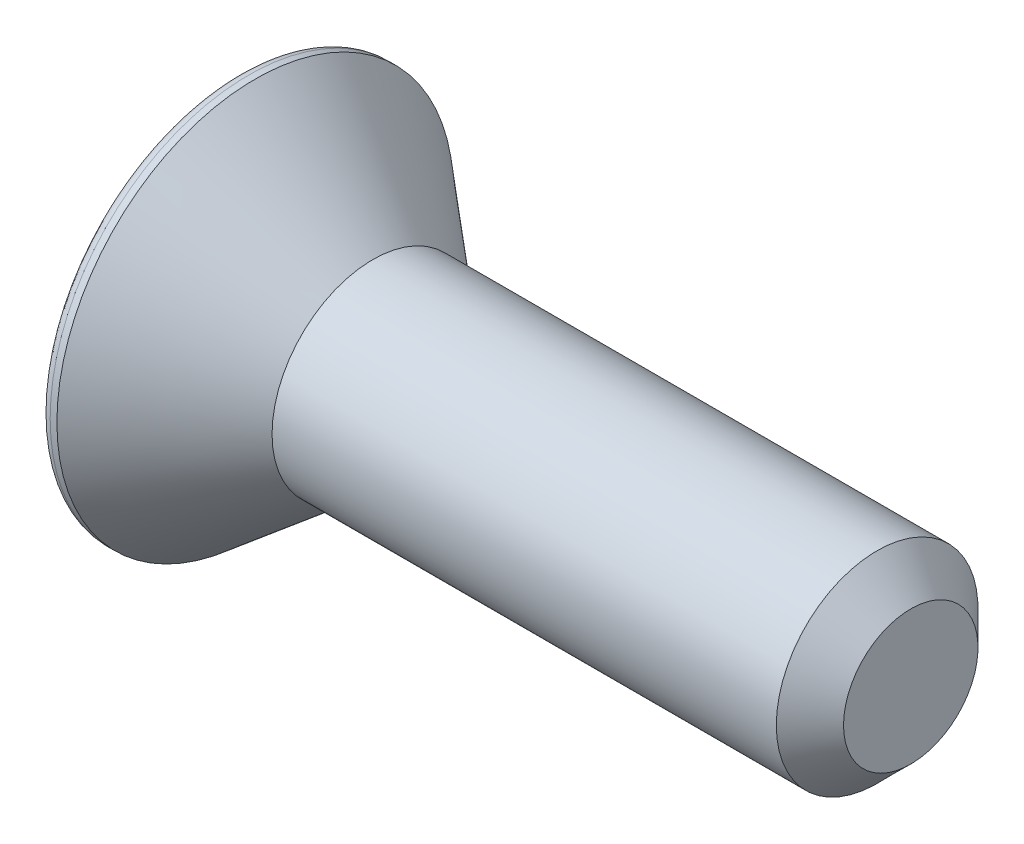
ISO-10303-21;
HEADER;
FILE_DESCRIPTION(('STEP AP214'),'2;1');
FILE_NAME('part.step','',(''),(''),'','','');
FILE_SCHEMA(('AUTOMOTIVE_DESIGN { 1 0 10303 214 1 1 1 1 }'));
ENDSEC;
DATA;
#1=APPLICATION_CONTEXT('core data for automotive mechanical design processes');
#2=APPLICATION_PROTOCOL_DEFINITION('international standard','automotive_design',2000,#1);
#3=PRODUCT_CONTEXT('',#1,'mechanical');
#4=PRODUCT('Part','Part','',(#3));
#5=PRODUCT_RELATED_PRODUCT_CATEGORY('part','',(#4));
#6=PRODUCT_DEFINITION_FORMATION('','',#4);
#7=PRODUCT_DEFINITION_CONTEXT('part definition',#1,'design');
#8=PRODUCT_DEFINITION('design','',#6,#7);
#9=PRODUCT_DEFINITION_SHAPE('','',#8);
#10=(LENGTH_UNIT() NAMED_UNIT(*) SI_UNIT(.MILLI.,.METRE.));
#11=(NAMED_UNIT(*) PLANE_ANGLE_UNIT() SI_UNIT($,.RADIAN.));
#12=(NAMED_UNIT(*) SI_UNIT($,.STERADIAN.) SOLID_ANGLE_UNIT());
#13=UNCERTAINTY_MEASURE_WITH_UNIT(LENGTH_MEASURE(1.E-05),#10,'distance_accuracy_value','');
#14=(GEOMETRIC_REPRESENTATION_CONTEXT(3) GLOBAL_UNCERTAINTY_ASSIGNED_CONTEXT((#13)) GLOBAL_UNIT_ASSIGNED_CONTEXT((#10,
#11,#12)) REPRESENTATION_CONTEXT('',''));
#15=CARTESIAN_POINT('',(0.,0.,0.));
#16=DIRECTION('',(0.,0.,1.));
#17=DIRECTION('',(1.,0.,0.));
#18=AXIS2_PLACEMENT_3D('',#15,#16,#17);
#19=CARTESIAN_POINT('',(0.,0.,0.));
#20=DIRECTION('',(1.,0.,0.));
#21=DIRECTION('',(0.,0.,-1.));
#22=AXIS2_PLACEMENT_3D('',#19,#20,#21);
#23=PLANE('',#22);
#24=CARTESIAN_POINT('',(0.,0.,0.));
#25=DIRECTION('',(1.,0.,0.));
#26=DIRECTION('',(0.,0.,-1.));
#27=AXIS2_PLACEMENT_3D('',#24,#25,#26);
#28=CIRCLE('',#27,5.6);
#29=CARTESIAN_POINT('',(0.,0.,-5.6));
#30=VERTEX_POINT('',#29);
#31=EDGE_CURVE('E153',#30,#30,#28,.F.);
#32=ORIENTED_EDGE('',*,*,#31,.T.);
#33=EDGE_LOOP('',(#32));
#34=FACE_BOUND('',#33,.T.);
#35=DIRECTION('',(0.,0.,-1.));
#36=VECTOR('',#35,1.);
#37=CARTESIAN_POINT('',(0.,2.,1.15470053837925));
#38=LINE('',#37,#36);
#39=CARTESIAN_POINT('',(0.,2.,1.15470053837925));
#40=VERTEX_POINT('',#39);
#41=CARTESIAN_POINT('',(0.,2.,-1.15470053837925));
#42=VERTEX_POINT('',#41);
#43=EDGE_CURVE('E129',#40,#42,#38,.T.);
#44=ORIENTED_EDGE('',*,*,#43,.F.);
#45=DIRECTION('',(0.,0.866025403784438,-0.5));
#46=VECTOR('',#45,1.);
#47=CARTESIAN_POINT('',(0.,0.,2.3094010767585));
#48=LINE('',#47,#46);
#49=CARTESIAN_POINT('',(0.,0.,2.3094010767585));
#50=VERTEX_POINT('',#49);
#51=EDGE_CURVE('E55',#50,#40,#48,.T.);
#52=ORIENTED_EDGE('',*,*,#51,.F.);
#53=DIRECTION('',(0.,0.866025403784438,0.5));
#54=VECTOR('',#53,1.);
#55=CARTESIAN_POINT('',(0.,-2.,1.15470053837925));
#56=LINE('',#55,#54);
#57=CARTESIAN_POINT('',(0.,-2.,1.15470053837925));
#58=VERTEX_POINT('',#57);
#59=EDGE_CURVE('E138',#58,#50,#56,.T.);
#60=ORIENTED_EDGE('',*,*,#59,.F.);
#61=DIRECTION('',(0.,0.,1.));
#62=VECTOR('',#61,1.);
#63=CARTESIAN_POINT('',(0.,-2.,-1.15470053837925));
#64=LINE('',#63,#62);
#65=CARTESIAN_POINT('',(0.,-2.,-1.15470053837925));
#66=VERTEX_POINT('',#65);
#67=EDGE_CURVE('E136',#66,#58,#64,.T.);
#68=ORIENTED_EDGE('',*,*,#67,.F.);
#69=DIRECTION('',(0.,-0.866025403784439,0.5));
#70=VECTOR('',#69,1.);
#71=CARTESIAN_POINT('',(0.,0.,-2.3094010767585));
#72=LINE('',#71,#70);
#73=CARTESIAN_POINT('',(0.,0.,-2.3094010767585));
#74=VERTEX_POINT('',#73);
#75=EDGE_CURVE('E103',#74,#66,#72,.T.);
#76=ORIENTED_EDGE('',*,*,#75,.F.);
#77=DIRECTION('',(0.,-0.866025403784439,-0.5));
#78=VECTOR('',#77,1.);
#79=CARTESIAN_POINT('',(0.,2.,-1.15470053837925));
#80=LINE('',#79,#78);
#81=EDGE_CURVE('E132',#42,#74,#80,.T.);
#82=ORIENTED_EDGE('',*,*,#81,.F.);
#83=EDGE_LOOP('',(#44,#52,#60,#68,#76,#82));
#84=FACE_BOUND('',#83,.T.);
#85=ADVANCED_FACE('F39',(#34,#84),#23,.F.);
#86=CARTESIAN_POINT('',(0.,0.,0.));
#87=DIRECTION('',(-1.,0.,0.));
#88=DIRECTION('',(0.,0.,1.));
#89=AXIS2_PLACEMENT_3D('',#86,#87,#88);
#90=CYLINDRICAL_SURFACE('',#89,5.9);
#91=CARTESIAN_POINT('',(0.3,0.,0.));
#92=DIRECTION('',(1.,0.,0.));
#93=DIRECTION('',(0.,0.,-1.));
#94=AXIS2_PLACEMENT_3D('',#91,#92,#93);
#95=CIRCLE('',#94,5.9);
#96=CARTESIAN_POINT('',(0.3,0.,-5.9));
#97=VERTEX_POINT('',#96);
#98=EDGE_CURVE('E156',#97,#97,#95,.T.);
#99=ORIENTED_EDGE('',*,*,#98,.T.);
#100=EDGE_LOOP('',(#99));
#101=FACE_BOUND('',#100,.T.);
#102=CARTESIAN_POINT('',(0.5,0.,0.));
#103=DIRECTION('',(-1.,0.,0.));
#104=DIRECTION('',(0.,0.,1.));
#105=AXIS2_PLACEMENT_3D('',#102,#103,#104);
#106=CIRCLE('',#105,5.9);
#107=CARTESIAN_POINT('',(0.5,0.,5.9));
#108=VERTEX_POINT('',#107);
#109=EDGE_CURVE('E150',#108,#108,#106,.T.);
#110=ORIENTED_EDGE('',*,*,#109,.T.);
#111=EDGE_LOOP('',(#110));
#112=FACE_BOUND('',#111,.T.);
#113=ADVANCED_FACE('F173',(#101,#112),#90,.T.);
#114=CARTESIAN_POINT('',(4.,0.,0.));
#115=DIRECTION('',(-1.,0.,0.));
#116=DIRECTION('',(0.,0.,1.));
#117=AXIS2_PLACEMENT_3D('',#114,#115,#116);
#118=CONICAL_SURFACE('',#117,3.,0.691921382238859);
#119=ORIENTED_EDGE('',*,*,#109,.F.);
#120=EDGE_LOOP('',(#119));
#121=FACE_BOUND('',#120,.T.);
#122=CARTESIAN_POINT('',(4.,0.,0.));
#123=DIRECTION('',(-1.,0.,0.));
#124=DIRECTION('',(0.,0.,1.));
#125=AXIS2_PLACEMENT_3D('',#122,#123,#124);
#126=CIRCLE('',#125,3.);
#127=CARTESIAN_POINT('',(4.,0.,3.));
#128=VERTEX_POINT('',#127);
#129=EDGE_CURVE('E142',#128,#128,#126,.T.);
#130=ORIENTED_EDGE('',*,*,#129,.T.);
#131=EDGE_LOOP('',(#130));
#132=FACE_BOUND('',#131,.T.);
#133=ADVANCED_FACE('F179',(#121,#132),#118,.T.);
#134=CARTESIAN_POINT('',(0.,0.,0.));
#135=DIRECTION('',(-1.,0.,0.));
#136=DIRECTION('',(0.,0.,1.));
#137=AXIS2_PLACEMENT_3D('',#134,#135,#136);
#138=CYLINDRICAL_SURFACE('',#137,3.);
#139=CARTESIAN_POINT('',(19.,0.,0.));
#140=DIRECTION('',(-1.,0.,0.));
#141=DIRECTION('',(0.,0.,1.));
#142=AXIS2_PLACEMENT_3D('',#139,#140,#141);
#143=CIRCLE('',#142,3.);
#144=CARTESIAN_POINT('',(19.,0.,3.));
#145=VERTEX_POINT('',#144);
#146=EDGE_CURVE('E48',#145,#145,#143,.T.);
#147=ORIENTED_EDGE('',*,*,#146,.T.);
#148=EDGE_LOOP('',(#147));
#149=FACE_BOUND('',#148,.T.);
#150=ORIENTED_EDGE('',*,*,#129,.F.);
#151=EDGE_LOOP('',(#150));
#152=FACE_BOUND('',#151,.T.);
#153=ADVANCED_FACE('F161',(#149,#152),#138,.T.);
#154=CARTESIAN_POINT('',(20.,3.,0.));
#155=DIRECTION('',(-1.,0.,0.));
#156=DIRECTION('',(0.,0.,1.));
#157=AXIS2_PLACEMENT_3D('',#154,#155,#156);
#158=PLANE('',#157);
#159=CARTESIAN_POINT('',(20.,0.,0.));
#160=DIRECTION('',(-1.,0.,0.));
#161=DIRECTION('',(0.,0.,1.));
#162=AXIS2_PLACEMENT_3D('',#159,#160,#161);
#163=CIRCLE('',#162,1.99999999999998);
#164=CARTESIAN_POINT('',(20.,0.,1.99999999999998));
#165=VERTEX_POINT('',#164);
#166=EDGE_CURVE('E11',#165,#165,#163,.F.);
#167=ORIENTED_EDGE('',*,*,#166,.T.);
#168=EDGE_LOOP('',(#167));
#169=FACE_BOUND('',#168,.T.);
#170=ADVANCED_FACE('F189',(#169),#158,.F.);
#171=CARTESIAN_POINT('',(3.,0.,2.3094010767585));
#172=DIRECTION('',(0.,0.5,0.866025403784439));
#173=DIRECTION('',(0.,-0.866025403784439,0.5));
#174=AXIS2_PLACEMENT_3D('',#171,#172,#173);
#175=PLANE('',#174);
#176=ORIENTED_EDGE('',*,*,#51,.T.);
#177=DIRECTION('',(-1.,0.,0.));
#178=VECTOR('',#177,1.);
#179=CARTESIAN_POINT('',(3.,2.,1.15470053837925));
#180=LINE('',#179,#178);
#181=CARTESIAN_POINT('',(3.,2.,1.15470053837925));
#182=VERTEX_POINT('',#181);
#183=EDGE_CURVE('E85',#182,#40,#180,.T.);
#184=ORIENTED_EDGE('',*,*,#183,.F.);
#185=DIRECTION('',(0.,0.866025403784438,-0.5));
#186=VECTOR('',#185,1.);
#187=CARTESIAN_POINT('',(3.,0.,2.3094010767585));
#188=LINE('',#187,#186);
#189=CARTESIAN_POINT('',(3.,0.,2.3094010767585));
#190=VERTEX_POINT('',#189);
#191=EDGE_CURVE('E140',#190,#182,#188,.T.);
#192=ORIENTED_EDGE('',*,*,#191,.F.);
#193=DIRECTION('',(-1.,0.,0.));
#194=VECTOR('',#193,1.);
#195=CARTESIAN_POINT('',(3.,0.,2.3094010767585));
#196=LINE('',#195,#194);
#197=EDGE_CURVE('E63',#190,#50,#196,.T.);
#198=ORIENTED_EDGE('',*,*,#197,.T.);
#199=EDGE_LOOP('',(#176,#184,#192,#198));
#200=FACE_BOUND('',#199,.T.);
#201=ADVANCED_FACE('F192',(#200),#175,.F.);
#202=CARTESIAN_POINT('',(3.,-2.,1.15470053837925));
#203=DIRECTION('',(0.,-0.5,0.866025403784439));
#204=DIRECTION('',(0.,-0.866025403784439,-0.5));
#205=AXIS2_PLACEMENT_3D('',#202,#203,#204);
#206=PLANE('',#205);
#207=ORIENTED_EDGE('',*,*,#59,.T.);
#208=ORIENTED_EDGE('',*,*,#197,.F.);
#209=DIRECTION('',(0.,0.866025403784438,0.5));
#210=VECTOR('',#209,1.);
#211=CARTESIAN_POINT('',(3.,-2.,1.15470053837925));
#212=LINE('',#211,#210);
#213=CARTESIAN_POINT('',(3.,-2.,1.15470053837925));
#214=VERTEX_POINT('',#213);
#215=EDGE_CURVE('E115',#214,#190,#212,.T.);
#216=ORIENTED_EDGE('',*,*,#215,.F.);
#217=DIRECTION('',(-1.,0.,0.));
#218=VECTOR('',#217,1.);
#219=CARTESIAN_POINT('',(3.,-2.,1.15470053837925));
#220=LINE('',#219,#218);
#221=EDGE_CURVE('E107',#214,#58,#220,.T.);
#222=ORIENTED_EDGE('',*,*,#221,.T.);
#223=EDGE_LOOP('',(#207,#208,#216,#222));
#224=FACE_BOUND('',#223,.T.);
#225=ADVANCED_FACE('F196',(#224),#206,.F.);
#226=CARTESIAN_POINT('',(3.,-2.,-1.15470053837925));
#227=DIRECTION('',(0.,-1.,0.));
#228=DIRECTION('',(0.,0.,-1.));
#229=AXIS2_PLACEMENT_3D('',#226,#227,#228);
#230=PLANE('',#229);
#231=ORIENTED_EDGE('',*,*,#67,.T.);
#232=ORIENTED_EDGE('',*,*,#221,.F.);
#233=DIRECTION('',(0.,0.,1.));
#234=VECTOR('',#233,1.);
#235=CARTESIAN_POINT('',(3.,-2.,-1.15470053837925));
#236=LINE('',#235,#234);
#237=CARTESIAN_POINT('',(3.,-2.,-1.15470053837925));
#238=VERTEX_POINT('',#237);
#239=EDGE_CURVE('E111',#238,#214,#236,.T.);
#240=ORIENTED_EDGE('',*,*,#239,.F.);
#241=DIRECTION('',(-1.,0.,0.));
#242=VECTOR('',#241,1.);
#243=CARTESIAN_POINT('',(3.,-2.,-1.15470053837925));
#244=LINE('',#243,#242);
#245=EDGE_CURVE('E96',#238,#66,#244,.T.);
#246=ORIENTED_EDGE('',*,*,#245,.T.);
#247=EDGE_LOOP('',(#231,#232,#240,#246));
#248=FACE_BOUND('',#247,.T.);
#249=ADVANCED_FACE('F112',(#248),#230,.F.);
#250=CARTESIAN_POINT('',(3.,0.,-2.3094010767585));
#251=DIRECTION('',(0.,-0.5,-0.866025403784439));
#252=DIRECTION('',(0.,0.866025403784439,-0.5));
#253=AXIS2_PLACEMENT_3D('',#250,#251,#252);
#254=PLANE('',#253);
#255=ORIENTED_EDGE('',*,*,#75,.T.);
#256=ORIENTED_EDGE('',*,*,#245,.F.);
#257=DIRECTION('',(0.,-0.866025403784439,0.5));
#258=VECTOR('',#257,1.);
#259=CARTESIAN_POINT('',(3.,0.,-2.3094010767585));
#260=LINE('',#259,#258);
#261=CARTESIAN_POINT('',(3.,0.,-2.3094010767585));
#262=VERTEX_POINT('',#261);
#263=EDGE_CURVE('E100',#262,#238,#260,.T.);
#264=ORIENTED_EDGE('',*,*,#263,.F.);
#265=DIRECTION('',(-1.,0.,0.));
#266=VECTOR('',#265,1.);
#267=CARTESIAN_POINT('',(3.,0.,-2.3094010767585));
#268=LINE('',#267,#266);
#269=EDGE_CURVE('E108',#262,#74,#268,.T.);
#270=ORIENTED_EDGE('',*,*,#269,.T.);
#271=EDGE_LOOP('',(#255,#256,#264,#270));
#272=FACE_BOUND('',#271,.T.);
#273=ADVANCED_FACE('F98',(#272),#254,.F.);
#274=CARTESIAN_POINT('',(3.,2.,-1.15470053837925));
#275=DIRECTION('',(0.,0.5,-0.866025403784439));
#276=DIRECTION('',(0.,0.866025403784439,0.5));
#277=AXIS2_PLACEMENT_3D('',#274,#275,#276);
#278=PLANE('',#277);
#279=ORIENTED_EDGE('',*,*,#81,.T.);
#280=ORIENTED_EDGE('',*,*,#269,.F.);
#281=DIRECTION('',(0.,-0.866025403784439,-0.5));
#282=VECTOR('',#281,1.);
#283=CARTESIAN_POINT('',(3.,2.,-1.15470053837925));
#284=LINE('',#283,#282);
#285=CARTESIAN_POINT('',(3.,2.,-1.15470053837925));
#286=VERTEX_POINT('',#285);
#287=EDGE_CURVE('E121',#286,#262,#284,.T.);
#288=ORIENTED_EDGE('',*,*,#287,.F.);
#289=DIRECTION('',(-1.,0.,0.));
#290=VECTOR('',#289,1.);
#291=CARTESIAN_POINT('',(3.,2.,-1.15470053837925));
#292=LINE('',#291,#290);
#293=EDGE_CURVE('E145',#286,#42,#292,.T.);
#294=ORIENTED_EDGE('',*,*,#293,.T.);
#295=EDGE_LOOP('',(#279,#280,#288,#294));
#296=FACE_BOUND('',#295,.T.);
#297=ADVANCED_FACE('F200',(#296),#278,.F.);
#298=CARTESIAN_POINT('',(3.,2.,1.15470053837925));
#299=DIRECTION('',(0.,1.,0.));
#300=DIRECTION('',(0.,0.,1.));
#301=AXIS2_PLACEMENT_3D('',#298,#299,#300);
#302=PLANE('',#301);
#303=ORIENTED_EDGE('',*,*,#43,.T.);
#304=ORIENTED_EDGE('',*,*,#293,.F.);
#305=DIRECTION('',(0.,0.,-1.));
#306=VECTOR('',#305,1.);
#307=CARTESIAN_POINT('',(3.,2.,1.15470053837925));
#308=LINE('',#307,#306);
#309=EDGE_CURVE('E123',#182,#286,#308,.T.);
#310=ORIENTED_EDGE('',*,*,#309,.F.);
#311=ORIENTED_EDGE('',*,*,#183,.T.);
#312=EDGE_LOOP('',(#303,#304,#310,#311));
#313=FACE_BOUND('',#312,.T.);
#314=ADVANCED_FACE('F197',(#313),#302,.F.);
#315=CARTESIAN_POINT('',(3.,0.,0.));
#316=DIRECTION('',(-1.,0.,0.));
#317=DIRECTION('',(0.,0.,1.));
#318=AXIS2_PLACEMENT_3D('',#315,#316,#317);
#319=PLANE('',#318);
#320=ORIENTED_EDGE('',*,*,#191,.T.);
#321=ORIENTED_EDGE('',*,*,#309,.T.);
#322=ORIENTED_EDGE('',*,*,#287,.T.);
#323=ORIENTED_EDGE('',*,*,#263,.T.);
#324=ORIENTED_EDGE('',*,*,#239,.T.);
#325=ORIENTED_EDGE('',*,*,#215,.T.);
#326=EDGE_LOOP('',(#320,#321,#322,#323,#324,#325));
#327=FACE_BOUND('',#326,.T.);
#328=ADVANCED_FACE('F118',(#327),#319,.T.);
#329=CARTESIAN_POINT('',(0.3,0.,0.));
#330=DIRECTION('',(1.,0.,0.));
#331=DIRECTION('',(0.,0.,-1.));
#332=AXIS2_PLACEMENT_3D('',#329,#330,#331);
#333=TOROIDAL_SURFACE('',#332,5.6,0.3);
#334=ORIENTED_EDGE('',*,*,#98,.F.);
#335=EDGE_LOOP('',(#334));
#336=FACE_BOUND('',#335,.T.);
#337=ORIENTED_EDGE('',*,*,#31,.F.);
#338=EDGE_LOOP('',(#337));
#339=FACE_BOUND('',#338,.T.);
#340=ADVANCED_FACE('F165',(#336,#339),#333,.T.);
#341=CARTESIAN_POINT('',(19.,0.,0.));
#342=DIRECTION('',(-1.,0.,0.));
#343=DIRECTION('',(0.,0.,1.));
#344=AXIS2_PLACEMENT_3D('',#341,#342,#343);
#345=CONICAL_SURFACE('',#344,3.,0.785398163397453);
#346=ORIENTED_EDGE('',*,*,#166,.F.);
#347=EDGE_LOOP('',(#346));
#348=FACE_BOUND('',#347,.T.);
#349=ORIENTED_EDGE('',*,*,#146,.F.);
#350=EDGE_LOOP('',(#349));
#351=FACE_BOUND('',#350,.T.);
#352=ADVANCED_FACE('F42',(#348,#351),#345,.T.);
#353=CLOSED_SHELL('',(#85,#113,#133,#153,#170,#201,#225,#249,#273,#297,#314,#328,#340,#352));
#354=MANIFOLD_SOLID_BREP('B2',#353);
#355=ADVANCED_BREP_SHAPE_REPRESENTATION('',(#18,#354),#14);
#356=SHAPE_DEFINITION_REPRESENTATION(#9,#355);
ENDSEC;
END-ISO-10303-21;
